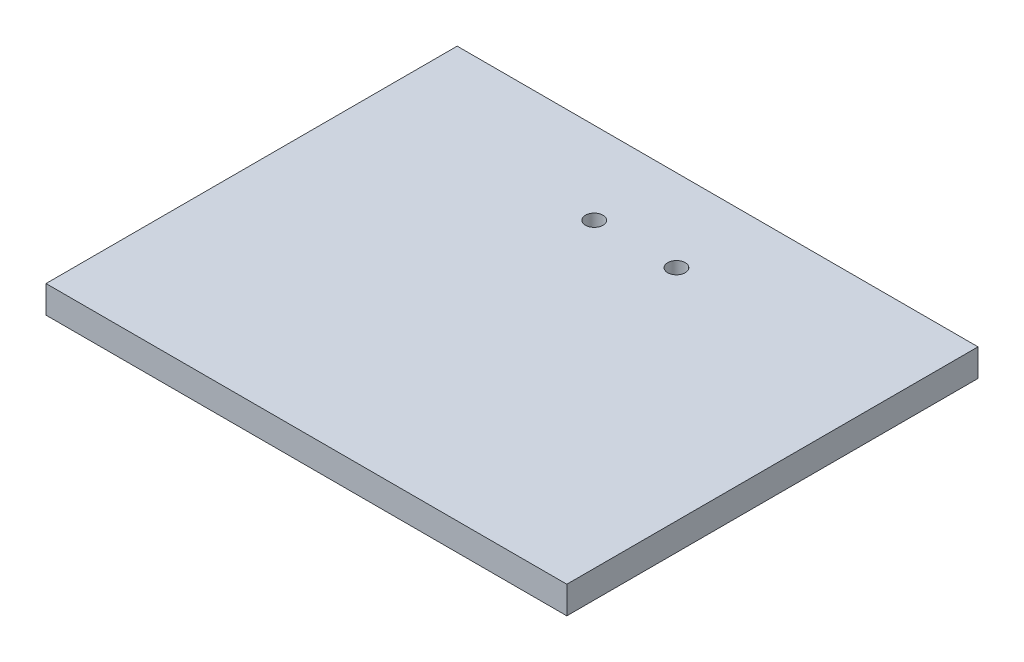
ISO-10303-21;
HEADER;
FILE_DESCRIPTION(('STEP AP214'),'2;1');
FILE_NAME('part.step','',(''),(''),'','','');
FILE_SCHEMA(('AUTOMOTIVE_DESIGN { 1 0 10303 214 1 1 1 1 }'));
ENDSEC;
DATA;
#1=APPLICATION_CONTEXT('core data for automotive mechanical design processes');
#2=APPLICATION_PROTOCOL_DEFINITION('international standard','automotive_design',2000,#1);
#3=PRODUCT_CONTEXT('',#1,'mechanical');
#4=PRODUCT('Part','Part','',(#3));
#5=PRODUCT_RELATED_PRODUCT_CATEGORY('part','',(#4));
#6=PRODUCT_DEFINITION_FORMATION('','',#4);
#7=PRODUCT_DEFINITION_CONTEXT('part definition',#1,'design');
#8=PRODUCT_DEFINITION('design','',#6,#7);
#9=PRODUCT_DEFINITION_SHAPE('','',#8);
#10=(LENGTH_UNIT() NAMED_UNIT(*) SI_UNIT(.MILLI.,.METRE.));
#11=(NAMED_UNIT(*) PLANE_ANGLE_UNIT() SI_UNIT($,.RADIAN.));
#12=(NAMED_UNIT(*) SI_UNIT($,.STERADIAN.) SOLID_ANGLE_UNIT());
#13=UNCERTAINTY_MEASURE_WITH_UNIT(LENGTH_MEASURE(1.E-05),#10,'distance_accuracy_value','');
#14=(GEOMETRIC_REPRESENTATION_CONTEXT(3) GLOBAL_UNCERTAINTY_ASSIGNED_CONTEXT((#13)) GLOBAL_UNIT_ASSIGNED_CONTEXT((#10,
#11,#12)) REPRESENTATION_CONTEXT('',''));
#15=CARTESIAN_POINT('',(0.,0.,0.));
#16=DIRECTION('',(0.,0.,1.));
#17=DIRECTION('',(1.,0.,0.));
#18=AXIS2_PLACEMENT_3D('',#15,#16,#17);
#19=CARTESIAN_POINT('',(47.5,5.,37.5));
#20=DIRECTION('',(-1.,0.,0.));
#21=DIRECTION('',(0.,0.,1.));
#22=AXIS2_PLACEMENT_3D('',#19,#20,#21);
#23=PLANE('',#22);
#24=DIRECTION('',(0.,0.,-1.));
#25=VECTOR('',#24,1.);
#26=CARTESIAN_POINT('',(47.5,0.,37.5));
#27=LINE('',#26,#25);
#28=CARTESIAN_POINT('',(47.5,0.,37.5));
#29=VERTEX_POINT('',#28);
#30=CARTESIAN_POINT('',(47.5,0.,-37.5));
#31=VERTEX_POINT('',#30);
#32=EDGE_CURVE('E96',#29,#31,#27,.T.);
#33=ORIENTED_EDGE('',*,*,#32,.T.);
#34=DIRECTION('',(0.,-1.,0.));
#35=VECTOR('',#34,1.);
#36=CARTESIAN_POINT('',(47.5,5.,-37.5));
#37=LINE('',#36,#35);
#38=CARTESIAN_POINT('',(47.5,5.,-37.5));
#39=VERTEX_POINT('',#38);
#40=EDGE_CURVE('E11',#39,#31,#37,.T.);
#41=ORIENTED_EDGE('',*,*,#40,.F.);
#42=DIRECTION('',(0.,0.,-1.));
#43=VECTOR('',#42,1.);
#44=CARTESIAN_POINT('',(47.5,5.,37.5));
#45=LINE('',#44,#43);
#46=CARTESIAN_POINT('',(47.5,5.,37.5));
#47=VERTEX_POINT('',#46);
#48=EDGE_CURVE('E84',#47,#39,#45,.T.);
#49=ORIENTED_EDGE('',*,*,#48,.F.);
#50=DIRECTION('',(0.,-1.,0.));
#51=VECTOR('',#50,1.);
#52=CARTESIAN_POINT('',(47.5,5.,37.5));
#53=LINE('',#52,#51);
#54=EDGE_CURVE('E92',#47,#29,#53,.T.);
#55=ORIENTED_EDGE('',*,*,#54,.T.);
#56=EDGE_LOOP('',(#33,#41,#49,#55));
#57=FACE_BOUND('',#56,.T.);
#58=ADVANCED_FACE('F33',(#57),#23,.F.);
#59=CARTESIAN_POINT('',(-47.5,5.,-37.5));
#60=DIRECTION('',(0.,0.,1.));
#61=DIRECTION('',(1.,0.,0.));
#62=AXIS2_PLACEMENT_3D('',#59,#60,#61);
#63=PLANE('',#62);
#64=DIRECTION('',(-1.,0.,0.));
#65=VECTOR('',#64,1.);
#66=CARTESIAN_POINT('',(-47.5,0.,-37.5));
#67=LINE('',#66,#65);
#68=CARTESIAN_POINT('',(-47.5,0.,-37.5));
#69=VERTEX_POINT('',#68);
#70=EDGE_CURVE('E88',#31,#69,#67,.T.);
#71=ORIENTED_EDGE('',*,*,#70,.T.);
#72=DIRECTION('',(0.,-1.,0.));
#73=VECTOR('',#72,1.);
#74=CARTESIAN_POINT('',(-47.5,5.,-37.5));
#75=LINE('',#74,#73);
#76=CARTESIAN_POINT('',(-47.5,5.,-37.5));
#77=VERTEX_POINT('',#76);
#78=EDGE_CURVE('E41',#77,#69,#75,.T.);
#79=ORIENTED_EDGE('',*,*,#78,.F.);
#80=DIRECTION('',(-1.,0.,0.));
#81=VECTOR('',#80,1.);
#82=CARTESIAN_POINT('',(-47.5,5.,-37.5));
#83=LINE('',#82,#81);
#84=EDGE_CURVE('E79',#39,#77,#83,.T.);
#85=ORIENTED_EDGE('',*,*,#84,.F.);
#86=ORIENTED_EDGE('',*,*,#40,.T.);
#87=EDGE_LOOP('',(#71,#79,#85,#86));
#88=FACE_BOUND('',#87,.T.);
#89=ADVANCED_FACE('F87',(#88),#63,.F.);
#90=CARTESIAN_POINT('',(-47.5,5.,37.5));
#91=DIRECTION('',(1.,0.,0.));
#92=DIRECTION('',(0.,0.,-1.));
#93=AXIS2_PLACEMENT_3D('',#90,#91,#92);
#94=PLANE('',#93);
#95=DIRECTION('',(0.,0.,1.));
#96=VECTOR('',#95,1.);
#97=CARTESIAN_POINT('',(-47.5,0.,37.5));
#98=LINE('',#97,#96);
#99=CARTESIAN_POINT('',(-47.5,0.,37.5));
#100=VERTEX_POINT('',#99);
#101=EDGE_CURVE('E66',#69,#100,#98,.T.);
#102=ORIENTED_EDGE('',*,*,#101,.T.);
#103=DIRECTION('',(0.,-1.,0.));
#104=VECTOR('',#103,1.);
#105=CARTESIAN_POINT('',(-47.5,5.,37.5));
#106=LINE('',#105,#104);
#107=CARTESIAN_POINT('',(-47.5,5.,37.5));
#108=VERTEX_POINT('',#107);
#109=EDGE_CURVE('E89',#108,#100,#106,.T.);
#110=ORIENTED_EDGE('',*,*,#109,.F.);
#111=DIRECTION('',(0.,0.,1.));
#112=VECTOR('',#111,1.);
#113=CARTESIAN_POINT('',(-47.5,5.,37.5));
#114=LINE('',#113,#112);
#115=EDGE_CURVE('E82',#77,#108,#114,.T.);
#116=ORIENTED_EDGE('',*,*,#115,.F.);
#117=ORIENTED_EDGE('',*,*,#78,.T.);
#118=EDGE_LOOP('',(#102,#110,#116,#117));
#119=FACE_BOUND('',#118,.T.);
#120=ADVANCED_FACE('F90',(#119),#94,.F.);
#121=CARTESIAN_POINT('',(-47.5,5.,37.5));
#122=DIRECTION('',(0.,0.,-1.));
#123=DIRECTION('',(-1.,0.,0.));
#124=AXIS2_PLACEMENT_3D('',#121,#122,#123);
#125=PLANE('',#124);
#126=DIRECTION('',(1.,0.,0.));
#127=VECTOR('',#126,1.);
#128=CARTESIAN_POINT('',(-47.5,0.,37.5));
#129=LINE('',#128,#127);
#130=EDGE_CURVE('E72',#100,#29,#129,.T.);
#131=ORIENTED_EDGE('',*,*,#130,.T.);
#132=ORIENTED_EDGE('',*,*,#54,.F.);
#133=DIRECTION('',(1.,0.,0.));
#134=VECTOR('',#133,1.);
#135=CARTESIAN_POINT('',(-47.5,5.,37.5));
#136=LINE('',#135,#134);
#137=EDGE_CURVE('E49',#108,#47,#136,.T.);
#138=ORIENTED_EDGE('',*,*,#137,.F.);
#139=ORIENTED_EDGE('',*,*,#109,.T.);
#140=EDGE_LOOP('',(#131,#132,#138,#139));
#141=FACE_BOUND('',#140,.T.);
#142=ADVANCED_FACE('F104',(#141),#125,.F.);
#143=CARTESIAN_POINT('',(0.,5.,0.));
#144=DIRECTION('',(0.,-1.,0.));
#145=DIRECTION('',(0.,0.,-1.));
#146=AXIS2_PLACEMENT_3D('',#143,#144,#145);
#147=PLANE('',#146);
#148=CARTESIAN_POINT('',(7.5,5.,-22.5));
#149=DIRECTION('',(0.,-1.,0.));
#150=DIRECTION('',(0.,0.,-1.));
#151=AXIS2_PLACEMENT_3D('',#148,#149,#150);
#152=CIRCLE('',#151,1.6);
#153=CARTESIAN_POINT('',(7.5,5.,-24.1));
#154=VERTEX_POINT('',#153);
#155=EDGE_CURVE('E99',#154,#154,#152,.F.);
#156=ORIENTED_EDGE('',*,*,#155,.F.);
#157=EDGE_LOOP('',(#156));
#158=FACE_BOUND('',#157,.T.);
#159=CARTESIAN_POINT('',(-7.5,5.,-22.5));
#160=DIRECTION('',(0.,-1.,0.));
#161=DIRECTION('',(0.,0.,-1.));
#162=AXIS2_PLACEMENT_3D('',#159,#160,#161);
#163=CIRCLE('',#162,1.6);
#164=CARTESIAN_POINT('',(-7.5,5.,-24.1));
#165=VERTEX_POINT('',#164);
#166=EDGE_CURVE('E110',#165,#165,#163,.F.);
#167=ORIENTED_EDGE('',*,*,#166,.F.);
#168=EDGE_LOOP('',(#167));
#169=FACE_BOUND('',#168,.T.);
#170=ORIENTED_EDGE('',*,*,#48,.T.);
#171=ORIENTED_EDGE('',*,*,#84,.T.);
#172=ORIENTED_EDGE('',*,*,#115,.T.);
#173=ORIENTED_EDGE('',*,*,#137,.T.);
#174=EDGE_LOOP('',(#170,#171,#172,#173));
#175=FACE_BOUND('',#174,.T.);
#176=ADVANCED_FACE('F80',(#158,#169,#175),#147,.F.);
#177=CARTESIAN_POINT('',(0.,0.,0.));
#178=DIRECTION('',(0.,-1.,0.));
#179=DIRECTION('',(0.,0.,-1.));
#180=AXIS2_PLACEMENT_3D('',#177,#178,#179);
#181=PLANE('',#180);
#182=CARTESIAN_POINT('',(7.5,0.,-22.5));
#183=DIRECTION('',(0.,-1.,0.));
#184=DIRECTION('',(0.,0.,-1.));
#185=AXIS2_PLACEMENT_3D('',#182,#183,#184);
#186=CIRCLE('',#185,1.6);
#187=CARTESIAN_POINT('',(7.5,0.,-24.1));
#188=VERTEX_POINT('',#187);
#189=EDGE_CURVE('E113',#188,#188,#186,.T.);
#190=ORIENTED_EDGE('',*,*,#189,.F.);
#191=EDGE_LOOP('',(#190));
#192=FACE_BOUND('',#191,.T.);
#193=CARTESIAN_POINT('',(-7.5,0.,-22.5));
#194=DIRECTION('',(0.,-1.,0.));
#195=DIRECTION('',(0.,0.,1.));
#196=AXIS2_PLACEMENT_3D('',#193,#194,#195);
#197=CIRCLE('',#196,1.6);
#198=CARTESIAN_POINT('',(-7.5,0.,-20.9));
#199=VERTEX_POINT('',#198);
#200=EDGE_CURVE('E114',#199,#199,#197,.T.);
#201=ORIENTED_EDGE('',*,*,#200,.F.);
#202=EDGE_LOOP('',(#201));
#203=FACE_BOUND('',#202,.T.);
#204=ORIENTED_EDGE('',*,*,#32,.F.);
#205=ORIENTED_EDGE('',*,*,#130,.F.);
#206=ORIENTED_EDGE('',*,*,#101,.F.);
#207=ORIENTED_EDGE('',*,*,#70,.F.);
#208=EDGE_LOOP('',(#204,#205,#206,#207));
#209=FACE_BOUND('',#208,.T.);
#210=ADVANCED_FACE('F107',(#192,#203,#209),#181,.T.);
#211=CARTESIAN_POINT('',(-7.5,5.001,-22.5));
#212=DIRECTION('',(0.,-1.,0.));
#213=DIRECTION('',(0.,0.,-1.));
#214=AXIS2_PLACEMENT_3D('',#211,#212,#213);
#215=CYLINDRICAL_SURFACE('',#214,1.6);
#216=ORIENTED_EDGE('',*,*,#200,.T.);
#217=EDGE_LOOP('',(#216));
#218=FACE_BOUND('',#217,.T.);
#219=ORIENTED_EDGE('',*,*,#166,.T.);
#220=EDGE_LOOP('',(#219));
#221=FACE_BOUND('',#220,.T.);
#222=ADVANCED_FACE('F127',(#218,#221),#215,.F.);
#223=CARTESIAN_POINT('',(7.5,5.001,-22.5));
#224=DIRECTION('',(0.,-1.,0.));
#225=DIRECTION('',(0.,0.,-1.));
#226=AXIS2_PLACEMENT_3D('',#223,#224,#225);
#227=CYLINDRICAL_SURFACE('',#226,1.6);
#228=ORIENTED_EDGE('',*,*,#189,.T.);
#229=EDGE_LOOP('',(#228));
#230=FACE_BOUND('',#229,.T.);
#231=ORIENTED_EDGE('',*,*,#155,.T.);
#232=EDGE_LOOP('',(#231));
#233=FACE_BOUND('',#232,.T.);
#234=ADVANCED_FACE('F122',(#230,#233),#227,.F.);
#235=CLOSED_SHELL('',(#58,#89,#120,#142,#176,#210,#222,#234));
#236=MANIFOLD_SOLID_BREP('B2',#235);
#237=ADVANCED_BREP_SHAPE_REPRESENTATION('',(#18,#236),#14);
#238=SHAPE_DEFINITION_REPRESENTATION(#9,#237);
ENDSEC;
END-ISO-10303-21;
